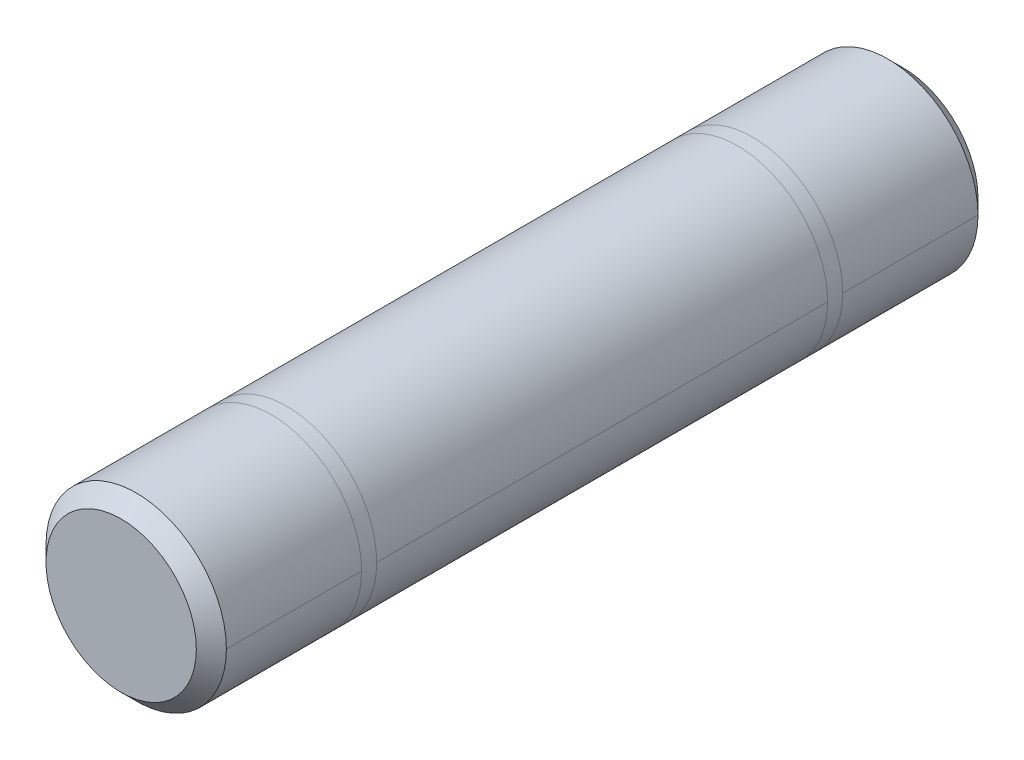
ISO-10303-21;
HEADER;
FILE_DESCRIPTION(('STEP AP214'),'2;1');
FILE_NAME('part.step','',(''),(''),'','','');
FILE_SCHEMA(('AUTOMOTIVE_DESIGN { 1 0 10303 214 1 1 1 1 }'));
ENDSEC;
DATA;
#1=APPLICATION_CONTEXT('core data for automotive mechanical design processes');
#2=APPLICATION_PROTOCOL_DEFINITION('international standard','automotive_design',2000,#1);
#3=PRODUCT_CONTEXT('',#1,'mechanical');
#4=PRODUCT('Part','Part','',(#3));
#5=PRODUCT_RELATED_PRODUCT_CATEGORY('part','',(#4));
#6=PRODUCT_DEFINITION_FORMATION('','',#4);
#7=PRODUCT_DEFINITION_CONTEXT('part definition',#1,'design');
#8=PRODUCT_DEFINITION('design','',#6,#7);
#9=PRODUCT_DEFINITION_SHAPE('','',#8);
#10=(LENGTH_UNIT() NAMED_UNIT(*) SI_UNIT(.MILLI.,.METRE.));
#11=(NAMED_UNIT(*) PLANE_ANGLE_UNIT() SI_UNIT($,.RADIAN.));
#12=(NAMED_UNIT(*) SI_UNIT($,.STERADIAN.) SOLID_ANGLE_UNIT());
#13=UNCERTAINTY_MEASURE_WITH_UNIT(LENGTH_MEASURE(1.E-05),#10,'distance_accuracy_value','');
#14=(GEOMETRIC_REPRESENTATION_CONTEXT(3) GLOBAL_UNCERTAINTY_ASSIGNED_CONTEXT((#13)) GLOBAL_UNIT_ASSIGNED_CONTEXT((#10,
#11,#12)) REPRESENTATION_CONTEXT('',''));
#15=CARTESIAN_POINT('',(0.,0.,0.));
#16=DIRECTION('',(0.,0.,1.));
#17=DIRECTION('',(1.,0.,0.));
#18=AXIS2_PLACEMENT_3D('',#15,#16,#17);
#19=CARTESIAN_POINT('',(0.,0.,26.));
#20=DIRECTION('',(0.,0.,-1.));
#21=DIRECTION('',(-1.,0.,0.));
#22=AXIS2_PLACEMENT_3D('',#19,#20,#21);
#23=CYLINDRICAL_SURFACE('',#22,3.);
#24=CARTESIAN_POINT('',(0.,0.,5.50000000000033));
#25=DIRECTION('',(0.,0.,1.));
#26=DIRECTION('',(1.,0.,0.));
#27=AXIS2_PLACEMENT_3D('',#24,#25,#26);
#28=CIRCLE('',#27,3.);
#29=CARTESIAN_POINT('',(3.,0.,5.50000000000033));
#30=VERTEX_POINT('',#29);
#31=CARTESIAN_POINT('',(-3.,0.,5.50000000000033));
#32=VERTEX_POINT('',#31);
#33=EDGE_CURVE('E105',#30,#32,#28,.T.);
#34=ORIENTED_EDGE('',*,*,#33,.T.);
#35=DIRECTION('',(0.,0.,1.));
#36=VECTOR('',#35,1.);
#37=CARTESIAN_POINT('',(-3.,0.,26.));
#38=LINE('',#37,#36);
#39=CARTESIAN_POINT('',(-3.,0.,20.5000000000003));
#40=VERTEX_POINT('',#39);
#41=EDGE_CURVE('E12',#32,#40,#38,.T.);
#42=ORIENTED_EDGE('',*,*,#41,.T.);
#43=CARTESIAN_POINT('',(0.,0.,20.5000000000003));
#44=DIRECTION('',(0.,0.,1.));
#45=DIRECTION('',(1.,0.,0.));
#46=AXIS2_PLACEMENT_3D('',#43,#44,#45);
#47=CIRCLE('',#46,3.);
#48=CARTESIAN_POINT('',(3.,0.,20.5000000000003));
#49=VERTEX_POINT('',#48);
#50=EDGE_CURVE('E136',#49,#40,#47,.T.);
#51=ORIENTED_EDGE('',*,*,#50,.F.);
#52=DIRECTION('',(0.,0.,-1.));
#53=VECTOR('',#52,1.);
#54=CARTESIAN_POINT('',(3.,0.,26.));
#55=LINE('',#54,#53);
#56=EDGE_CURVE('E56',#49,#30,#55,.T.);
#57=ORIENTED_EDGE('',*,*,#56,.T.);
#58=EDGE_LOOP('',(#34,#42,#51,#57));
#59=FACE_BOUND('',#58,.T.);
#60=ADVANCED_FACE('F47',(#59),#23,.T.);
#61=CARTESIAN_POINT('',(0.,0.,21.));
#62=DIRECTION('',(0.,0.,1.));
#63=DIRECTION('',(1.,0.,0.));
#64=AXIS2_PLACEMENT_3D('',#61,#62,#63);
#65=CIRCLE('',#64,3.);
#66=CARTESIAN_POINT('',(3.,0.,21.));
#67=VERTEX_POINT('',#66);
#68=CARTESIAN_POINT('',(-3.,0.,21.));
#69=VERTEX_POINT('',#68);
#70=EDGE_CURVE('E145',#67,#69,#65,.T.);
#71=ORIENTED_EDGE('',*,*,#70,.T.);
#72=DIRECTION('',(0.,0.,1.));
#73=VECTOR('',#72,1.);
#74=CARTESIAN_POINT('',(-3.,0.,26.));
#75=LINE('',#74,#73);
#76=CARTESIAN_POINT('',(-3.,0.,25.5));
#77=VERTEX_POINT('',#76);
#78=EDGE_CURVE('E129',#69,#77,#75,.T.);
#79=ORIENTED_EDGE('',*,*,#78,.T.);
#80=CARTESIAN_POINT('',(0.,0.,25.5));
#81=DIRECTION('',(0.,0.,1.));
#82=DIRECTION('',(1.,0.,0.));
#83=AXIS2_PLACEMENT_3D('',#80,#81,#82);
#84=CIRCLE('',#83,3.);
#85=CARTESIAN_POINT('',(3.,0.,25.5));
#86=VERTEX_POINT('',#85);
#87=EDGE_CURVE('E165',#77,#86,#84,.F.);
#88=ORIENTED_EDGE('',*,*,#87,.T.);
#89=DIRECTION('',(0.,0.,-1.));
#90=VECTOR('',#89,1.);
#91=CARTESIAN_POINT('',(3.,0.,26.));
#92=LINE('',#91,#90);
#93=EDGE_CURVE('E125',#86,#67,#92,.T.);
#94=ORIENTED_EDGE('',*,*,#93,.T.);
#95=EDGE_LOOP('',(#71,#79,#88,#94));
#96=FACE_BOUND('',#95,.T.);
#97=ADVANCED_FACE('F173',(#96),#23,.T.);
#98=CARTESIAN_POINT('',(0.,0.,0.500000000000011));
#99=DIRECTION('',(0.,0.,1.));
#100=DIRECTION('',(1.,0.,0.));
#101=AXIS2_PLACEMENT_3D('',#98,#99,#100);
#102=CIRCLE('',#101,3.);
#103=CARTESIAN_POINT('',(3.,0.,0.500000000000011));
#104=VERTEX_POINT('',#103);
#105=CARTESIAN_POINT('',(-3.,0.,0.500000000000011));
#106=VERTEX_POINT('',#105);
#107=EDGE_CURVE('E159',#104,#106,#102,.T.);
#108=ORIENTED_EDGE('',*,*,#107,.T.);
#109=DIRECTION('',(0.,0.,1.));
#110=VECTOR('',#109,1.);
#111=CARTESIAN_POINT('',(-3.,0.,26.));
#112=LINE('',#111,#110);
#113=CARTESIAN_POINT('',(-3.,0.,4.99999999999999));
#114=VERTEX_POINT('',#113);
#115=EDGE_CURVE('E116',#106,#114,#112,.T.);
#116=ORIENTED_EDGE('',*,*,#115,.T.);
#117=CARTESIAN_POINT('',(0.,0.,4.99999999999999));
#118=DIRECTION('',(0.,0.,1.));
#119=DIRECTION('',(1.,0.,0.));
#120=AXIS2_PLACEMENT_3D('',#117,#118,#119);
#121=CIRCLE('',#120,3.);
#122=CARTESIAN_POINT('',(3.,0.,4.99999999999999));
#123=VERTEX_POINT('',#122);
#124=EDGE_CURVE('E102',#123,#114,#121,.T.);
#125=ORIENTED_EDGE('',*,*,#124,.F.);
#126=DIRECTION('',(0.,0.,-1.));
#127=VECTOR('',#126,1.);
#128=CARTESIAN_POINT('',(3.,0.,26.));
#129=LINE('',#128,#127);
#130=EDGE_CURVE('E108',#123,#104,#129,.T.);
#131=ORIENTED_EDGE('',*,*,#130,.T.);
#132=EDGE_LOOP('',(#108,#116,#125,#131));
#133=FACE_BOUND('',#132,.T.);
#134=ADVANCED_FACE('F118',(#133),#23,.T.);
#135=ORIENTED_EDGE('',*,*,#33,.F.);
#136=EDGE_CURVE('E138',#32,#30,#28,.T.);
#137=ORIENTED_EDGE('',*,*,#136,.F.);
#138=EDGE_LOOP('',(#135,#137));
#139=FACE_BOUND('',#138,.T.);
#140=ORIENTED_EDGE('',*,*,#124,.T.);
#141=EDGE_CURVE('E98',#114,#123,#121,.T.);
#142=ORIENTED_EDGE('',*,*,#141,.T.);
#143=EDGE_LOOP('',(#140,#142));
#144=FACE_BOUND('',#143,.T.);
#145=ADVANCED_FACE('F100',(#139,#144),#23,.T.);
#146=ORIENTED_EDGE('',*,*,#41,.F.);
#147=ORIENTED_EDGE('',*,*,#136,.T.);
#148=ORIENTED_EDGE('',*,*,#56,.F.);
#149=EDGE_CURVE('E142',#40,#49,#47,.T.);
#150=ORIENTED_EDGE('',*,*,#149,.F.);
#151=EDGE_LOOP('',(#146,#147,#148,#150));
#152=FACE_BOUND('',#151,.T.);
#153=ADVANCED_FACE('F231',(#152),#23,.T.);
#154=ORIENTED_EDGE('',*,*,#70,.F.);
#155=EDGE_CURVE('E150',#69,#67,#65,.T.);
#156=ORIENTED_EDGE('',*,*,#155,.F.);
#157=EDGE_LOOP('',(#154,#156));
#158=FACE_BOUND('',#157,.T.);
#159=ORIENTED_EDGE('',*,*,#50,.T.);
#160=ORIENTED_EDGE('',*,*,#149,.T.);
#161=EDGE_LOOP('',(#159,#160));
#162=FACE_BOUND('',#161,.T.);
#163=ADVANCED_FACE('F240',(#158,#162),#23,.T.);
#164=ORIENTED_EDGE('',*,*,#78,.F.);
#165=ORIENTED_EDGE('',*,*,#155,.T.);
#166=ORIENTED_EDGE('',*,*,#93,.F.);
#167=EDGE_CURVE('E162',#86,#77,#84,.F.);
#168=ORIENTED_EDGE('',*,*,#167,.T.);
#169=EDGE_LOOP('',(#164,#165,#166,#168));
#170=FACE_BOUND('',#169,.T.);
#171=ADVANCED_FACE('F176',(#170),#23,.T.);
#172=ORIENTED_EDGE('',*,*,#115,.F.);
#173=EDGE_CURVE('E111',#106,#104,#102,.T.);
#174=ORIENTED_EDGE('',*,*,#173,.T.);
#175=ORIENTED_EDGE('',*,*,#130,.F.);
#176=ORIENTED_EDGE('',*,*,#141,.F.);
#177=EDGE_LOOP('',(#172,#174,#175,#176));
#178=FACE_BOUND('',#177,.T.);
#179=ADVANCED_FACE('F109',(#178),#23,.T.);
#180=CARTESIAN_POINT('',(0.,0.,26.));
#181=DIRECTION('',(0.,0.,1.));
#182=DIRECTION('',(1.,0.,0.));
#183=AXIS2_PLACEMENT_3D('',#180,#181,#182);
#184=PLANE('',#183);
#185=CARTESIAN_POINT('',(0.,0.,26.));
#186=DIRECTION('',(0.,0.,1.));
#187=DIRECTION('',(1.,0.,0.));
#188=AXIS2_PLACEMENT_3D('',#185,#186,#187);
#189=CIRCLE('',#188,2.50000000000002);
#190=CARTESIAN_POINT('',(2.50000000000002,0.,26.));
#191=VERTEX_POINT('',#190);
#192=EDGE_CURVE('E151',#191,#191,#189,.T.);
#193=ORIENTED_EDGE('',*,*,#192,.T.);
#194=EDGE_LOOP('',(#193));
#195=FACE_BOUND('',#194,.T.);
#196=ADVANCED_FACE('F183',(#195),#184,.T.);
#197=CARTESIAN_POINT('',(0.,0.,0.));
#198=DIRECTION('',(0.,0.,1.));
#199=DIRECTION('',(1.,0.,0.));
#200=AXIS2_PLACEMENT_3D('',#197,#198,#199);
#201=PLANE('',#200);
#202=CARTESIAN_POINT('',(0.,0.,0.));
#203=DIRECTION('',(0.,0.,1.));
#204=DIRECTION('',(1.,0.,0.));
#205=AXIS2_PLACEMENT_3D('',#202,#203,#204);
#206=CIRCLE('',#205,2.49999999999998);
#207=CARTESIAN_POINT('',(2.49999999999998,0.,0.));
#208=VERTEX_POINT('',#207);
#209=EDGE_CURVE('E155',#208,#208,#206,.F.);
#210=ORIENTED_EDGE('',*,*,#209,.T.);
#211=EDGE_LOOP('',(#210));
#212=FACE_BOUND('',#211,.T.);
#213=ADVANCED_FACE('F185',(#212),#201,.F.);
#214=CARTESIAN_POINT('',(0.,0.,0.500000000000011));
#215=DIRECTION('',(0.,0.,1.));
#216=DIRECTION('',(1.,0.,0.));
#217=AXIS2_PLACEMENT_3D('',#214,#215,#216);
#218=CONICAL_SURFACE('',#217,3.,0.785398163397453);
#219=ORIENTED_EDGE('',*,*,#209,.F.);
#220=EDGE_LOOP('',(#219));
#221=FACE_BOUND('',#220,.T.);
#222=ORIENTED_EDGE('',*,*,#107,.F.);
#223=ORIENTED_EDGE('',*,*,#173,.F.);
#224=EDGE_LOOP('',(#222,#223));
#225=FACE_BOUND('',#224,.T.);
#226=ADVANCED_FACE('F180',(#221,#225),#218,.T.);
#227=CARTESIAN_POINT('',(0.,0.,26.));
#228=DIRECTION('',(0.,0.,-1.));
#229=DIRECTION('',(-1.,0.,0.));
#230=AXIS2_PLACEMENT_3D('',#227,#228,#229);
#231=CONICAL_SURFACE('',#230,2.50000000000002,0.785398163397443);
#232=ORIENTED_EDGE('',*,*,#167,.F.);
#233=ORIENTED_EDGE('',*,*,#87,.F.);
#234=EDGE_LOOP('',(#232,#233));
#235=FACE_BOUND('',#234,.T.);
#236=ORIENTED_EDGE('',*,*,#192,.F.);
#237=EDGE_LOOP('',(#236));
#238=FACE_BOUND('',#237,.T.);
#239=ADVANCED_FACE('F49',(#235,#238),#231,.T.);
#240=CLOSED_SHELL('',(#60,#97,#134,#145,#153,#163,#171,#179,#196,#213,#226,#239));
#241=MANIFOLD_SOLID_BREP('B2',#240);
#242=ADVANCED_BREP_SHAPE_REPRESENTATION('',(#18,#241),#14);
#243=SHAPE_DEFINITION_REPRESENTATION(#9,#242);
ENDSEC;
END-ISO-10303-21;
